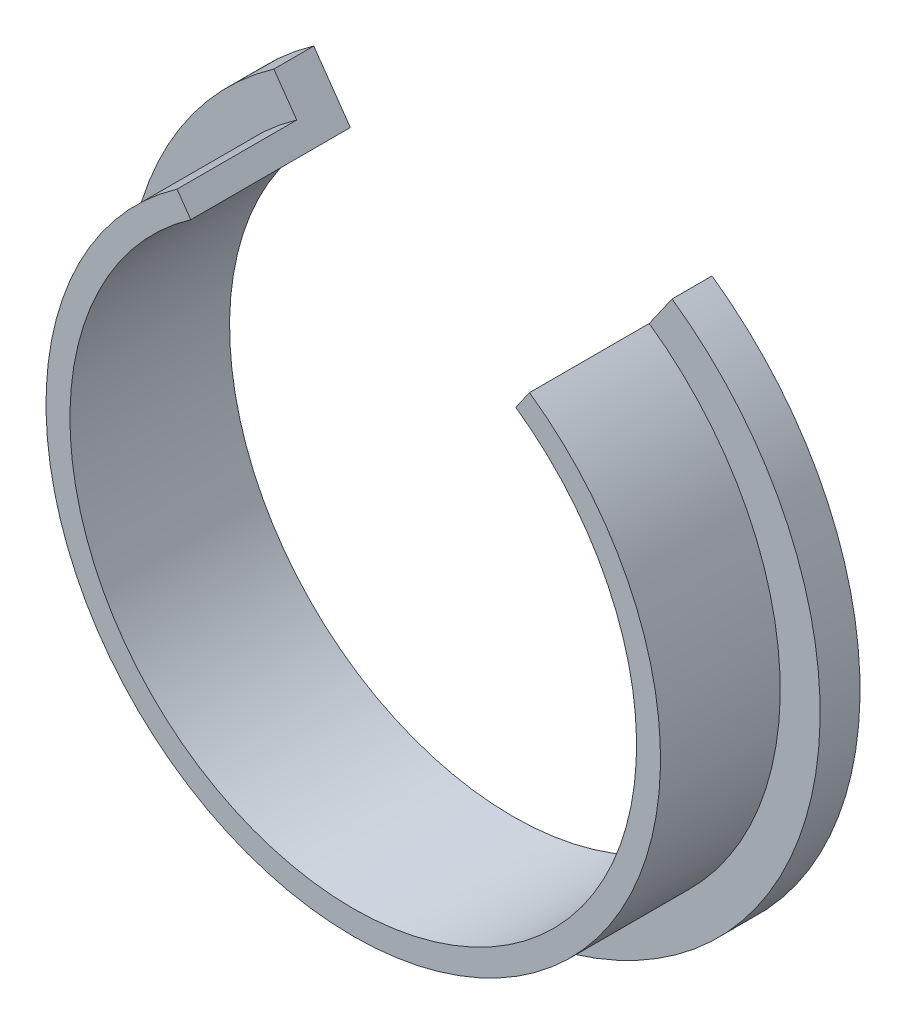
ISO-10303-21;
HEADER;
FILE_DESCRIPTION(('STEP AP214'),'2;1');
FILE_NAME('part.step','',(''),(''),'','','');
FILE_SCHEMA(('AUTOMOTIVE_DESIGN { 1 0 10303 214 1 1 1 1 }'));
ENDSEC;
DATA;
#1=APPLICATION_CONTEXT('core data for automotive mechanical design processes');
#2=APPLICATION_PROTOCOL_DEFINITION('international standard','automotive_design',2000,#1);
#3=PRODUCT_CONTEXT('',#1,'mechanical');
#4=PRODUCT('Part','Part','',(#3));
#5=PRODUCT_RELATED_PRODUCT_CATEGORY('part','',(#4));
#6=PRODUCT_DEFINITION_FORMATION('','',#4);
#7=PRODUCT_DEFINITION_CONTEXT('part definition',#1,'design');
#8=PRODUCT_DEFINITION('design','',#6,#7);
#9=PRODUCT_DEFINITION_SHAPE('','',#8);
#10=(LENGTH_UNIT() NAMED_UNIT(*) SI_UNIT(.MILLI.,.METRE.));
#11=(NAMED_UNIT(*) PLANE_ANGLE_UNIT() SI_UNIT($,.RADIAN.));
#12=(NAMED_UNIT(*) SI_UNIT($,.STERADIAN.) SOLID_ANGLE_UNIT());
#13=UNCERTAINTY_MEASURE_WITH_UNIT(LENGTH_MEASURE(1.E-05),#10,'distance_accuracy_value','');
#14=(GEOMETRIC_REPRESENTATION_CONTEXT(3) GLOBAL_UNCERTAINTY_ASSIGNED_CONTEXT((#13)) GLOBAL_UNIT_ASSIGNED_CONTEXT((#10,
#11,#12)) REPRESENTATION_CONTEXT('',''));
#15=CARTESIAN_POINT('',(0.,0.,0.));
#16=DIRECTION('',(0.,0.,1.));
#17=DIRECTION('',(1.,0.,0.));
#18=AXIS2_PLACEMENT_3D('',#15,#16,#17);
#19=CARTESIAN_POINT('',(0.,0.,5.));
#20=DIRECTION('',(0.,0.,-1.));
#21=DIRECTION('',(-1.,0.,0.));
#22=AXIS2_PLACEMENT_3D('',#19,#20,#21);
#23=CYLINDRICAL_SURFACE('',#22,43.5);
#24=CARTESIAN_POINT('',(0.,0.,0.));
#25=DIRECTION('',(0.,0.,1.));
#26=DIRECTION('',(1.,0.,0.));
#27=AXIS2_PLACEMENT_3D('',#24,#25,#26);
#28=CIRCLE('',#27,43.5);
#29=CARTESIAN_POINT('',(-24.9505749812706,35.6331139265711,0.));
#30=VERTEX_POINT('',#29);
#31=CARTESIAN_POINT('',(24.9505749812706,35.6331139265711,0.));
#32=VERTEX_POINT('',#31);
#33=EDGE_CURVE('E96',#30,#32,#28,.T.);
#34=ORIENTED_EDGE('',*,*,#33,.T.);
#35=DIRECTION('',(0.,0.,-1.));
#36=VECTOR('',#35,1.);
#37=CARTESIAN_POINT('',(24.9505749812706,35.6331139265711,20.));
#38=LINE('',#37,#36);
#39=CARTESIAN_POINT('',(24.9505749812706,35.6331139265711,5.));
#40=VERTEX_POINT('',#39);
#41=EDGE_CURVE('E99',#40,#32,#38,.T.);
#42=ORIENTED_EDGE('',*,*,#41,.F.);
#43=CARTESIAN_POINT('',(0.,0.,5.));
#44=DIRECTION('',(0.,0.,1.));
#45=DIRECTION('',(1.,0.,0.));
#46=AXIS2_PLACEMENT_3D('',#43,#44,#45);
#47=CIRCLE('',#46,43.5);
#48=CARTESIAN_POINT('',(-24.9505749812706,35.6331139265711,5.));
#49=VERTEX_POINT('',#48);
#50=EDGE_CURVE('E98',#49,#40,#47,.T.);
#51=ORIENTED_EDGE('',*,*,#50,.F.);
#52=DIRECTION('',(0.,0.,-1.));
#53=VECTOR('',#52,1.);
#54=CARTESIAN_POINT('',(-24.9505749812706,35.6331139265711,20.));
#55=LINE('',#54,#53);
#56=EDGE_CURVE('E84',#49,#30,#55,.T.);
#57=ORIENTED_EDGE('',*,*,#56,.T.);
#58=EDGE_LOOP('',(#34,#42,#51,#57));
#59=FACE_BOUND('',#58,.T.);
#60=ADVANCED_FACE('F32',(#59),#23,.T.);
#61=CARTESIAN_POINT('',(0.,0.,5.));
#62=DIRECTION('',(0.,0.,1.));
#63=DIRECTION('',(1.,0.,0.));
#64=AXIS2_PLACEMENT_3D('',#61,#62,#63);
#65=PLANE('',#64);
#66=DIRECTION('',(0.573576436351047,0.819152044288991,0.));
#67=VECTOR('',#66,1.);
#68=CARTESIAN_POINT('',(0.,0.,5.));
#69=LINE('',#68,#67);
#70=CARTESIAN_POINT('',(22.0826927995153,31.5373537051262,5.));
#71=VERTEX_POINT('',#70);
#72=EDGE_CURVE('E121',#71,#40,#69,.T.);
#73=ORIENTED_EDGE('',*,*,#72,.F.);
#74=CARTESIAN_POINT('',(0.,0.,5.));
#75=DIRECTION('',(0.,0.,1.));
#76=DIRECTION('',(1.,0.,0.));
#77=AXIS2_PLACEMENT_3D('',#74,#75,#76);
#78=CIRCLE('',#77,38.5);
#79=CARTESIAN_POINT('',(-22.0826927995153,31.5373537051262,5.));
#80=VERTEX_POINT('',#79);
#81=EDGE_CURVE('E104',#80,#71,#78,.T.);
#82=ORIENTED_EDGE('',*,*,#81,.F.);
#83=DIRECTION('',(0.573576436351047,-0.819152044288991,0.));
#84=VECTOR('',#83,1.);
#85=CARTESIAN_POINT('',(0.,0.,5.));
#86=LINE('',#85,#84);
#87=EDGE_CURVE('E126',#49,#80,#86,.T.);
#88=ORIENTED_EDGE('',*,*,#87,.F.);
#89=ORIENTED_EDGE('',*,*,#50,.T.);
#90=EDGE_LOOP('',(#73,#82,#88,#89));
#91=FACE_BOUND('',#90,.T.);
#92=ADVANCED_FACE('F148',(#91),#65,.T.);
#93=CARTESIAN_POINT('',(0.,0.,0.));
#94=DIRECTION('',(0.,0.,1.));
#95=DIRECTION('',(1.,0.,0.));
#96=AXIS2_PLACEMENT_3D('',#93,#94,#95);
#97=PLANE('',#96);
#98=CARTESIAN_POINT('',(0.,0.,0.));
#99=DIRECTION('',(0.,0.,1.));
#100=DIRECTION('',(1.,0.,0.));
#101=AXIS2_PLACEMENT_3D('',#98,#99,#100);
#102=CIRCLE('',#101,35.5);
#103=CARTESIAN_POINT('',(-20.3619634904622,29.0798975722592,0.));
#104=VERTEX_POINT('',#103);
#105=CARTESIAN_POINT('',(20.3619634904622,29.0798975722592,0.));
#106=VERTEX_POINT('',#105);
#107=EDGE_CURVE('E107',#104,#106,#102,.T.);
#108=ORIENTED_EDGE('',*,*,#107,.T.);
#109=DIRECTION('',(-0.573576436351047,-0.819152044288991,0.));
#110=VECTOR('',#109,1.);
#111=CARTESIAN_POINT('',(0.,0.,0.));
#112=LINE('',#111,#110);
#113=EDGE_CURVE('E54',#32,#106,#112,.T.);
#114=ORIENTED_EDGE('',*,*,#113,.F.);
#115=ORIENTED_EDGE('',*,*,#33,.F.);
#116=DIRECTION('',(-0.573576436351047,0.819152044288991,0.));
#117=VECTOR('',#116,1.);
#118=CARTESIAN_POINT('',(0.,0.,0.));
#119=LINE('',#118,#117);
#120=EDGE_CURVE('E81',#104,#30,#119,.T.);
#121=ORIENTED_EDGE('',*,*,#120,.F.);
#122=EDGE_LOOP('',(#108,#114,#115,#121));
#123=FACE_BOUND('',#122,.T.);
#124=ADVANCED_FACE('F101',(#123),#97,.F.);
#125=CARTESIAN_POINT('',(0.,0.,20.));
#126=DIRECTION('',(0.,0.,-1.));
#127=DIRECTION('',(-1.,0.,0.));
#128=AXIS2_PLACEMENT_3D('',#125,#126,#127);
#129=CYLINDRICAL_SURFACE('',#128,38.5);
#130=ORIENTED_EDGE('',*,*,#81,.T.);
#131=DIRECTION('',(0.,0.,-1.));
#132=VECTOR('',#131,1.);
#133=CARTESIAN_POINT('',(22.0826927995153,31.5373537051262,20.));
#134=LINE('',#133,#132);
#135=CARTESIAN_POINT('',(22.0826927995153,31.5373537051262,20.));
#136=VERTEX_POINT('',#135);
#137=EDGE_CURVE('E124',#71,#136,#134,.F.);
#138=ORIENTED_EDGE('',*,*,#137,.T.);
#139=CARTESIAN_POINT('',(0.,0.,20.));
#140=DIRECTION('',(0.,0.,1.));
#141=DIRECTION('',(1.,0.,0.));
#142=AXIS2_PLACEMENT_3D('',#139,#140,#141);
#143=CIRCLE('',#142,38.5);
#144=CARTESIAN_POINT('',(-22.0826927995153,31.5373537051262,20.));
#145=VERTEX_POINT('',#144);
#146=EDGE_CURVE('E102',#145,#136,#143,.T.);
#147=ORIENTED_EDGE('',*,*,#146,.F.);
#148=DIRECTION('',(0.,0.,-1.));
#149=VECTOR('',#148,1.);
#150=CARTESIAN_POINT('',(-22.0826927995153,31.5373537051262,20.));
#151=LINE('',#150,#149);
#152=EDGE_CURVE('E128',#145,#80,#151,.T.);
#153=ORIENTED_EDGE('',*,*,#152,.T.);
#154=EDGE_LOOP('',(#130,#138,#147,#153));
#155=FACE_BOUND('',#154,.T.);
#156=ADVANCED_FACE('F157',(#155),#129,.T.);
#157=CARTESIAN_POINT('',(0.,0.,20.));
#158=DIRECTION('',(0.,0.,1.));
#159=DIRECTION('',(1.,0.,0.));
#160=AXIS2_PLACEMENT_3D('',#157,#158,#159);
#161=PLANE('',#160);
#162=DIRECTION('',(-0.573576436351047,-0.819152044288991,0.));
#163=VECTOR('',#162,1.);
#164=CARTESIAN_POINT('',(0.,0.,20.));
#165=LINE('',#164,#163);
#166=CARTESIAN_POINT('',(20.3619634904622,29.0798975722592,20.));
#167=VERTEX_POINT('',#166);
#168=EDGE_CURVE('E90',#136,#167,#165,.T.);
#169=ORIENTED_EDGE('',*,*,#168,.T.);
#170=CARTESIAN_POINT('',(0.,0.,20.));
#171=DIRECTION('',(0.,0.,1.));
#172=DIRECTION('',(1.,0.,0.));
#173=AXIS2_PLACEMENT_3D('',#170,#171,#172);
#174=CIRCLE('',#173,35.5);
#175=CARTESIAN_POINT('',(-20.3619634904622,29.0798975722592,20.));
#176=VERTEX_POINT('',#175);
#177=EDGE_CURVE('E119',#176,#167,#174,.T.);
#178=ORIENTED_EDGE('',*,*,#177,.F.);
#179=DIRECTION('',(-0.573576436351047,0.819152044288991,0.));
#180=VECTOR('',#179,1.);
#181=CARTESIAN_POINT('',(0.,0.,20.));
#182=LINE('',#181,#180);
#183=EDGE_CURVE('E46',#176,#145,#182,.T.);
#184=ORIENTED_EDGE('',*,*,#183,.T.);
#185=ORIENTED_EDGE('',*,*,#146,.T.);
#186=EDGE_LOOP('',(#169,#178,#184,#185));
#187=FACE_BOUND('',#186,.T.);
#188=ADVANCED_FACE('F135',(#187),#161,.T.);
#189=CARTESIAN_POINT('',(0.,0.,0.));
#190=DIRECTION('',(0.,0.,1.));
#191=DIRECTION('',(1.,0.,0.));
#192=AXIS2_PLACEMENT_3D('',#189,#190,#191);
#193=CYLINDRICAL_SURFACE('',#192,35.5);
#194=ORIENTED_EDGE('',*,*,#177,.T.);
#195=DIRECTION('',(0.,0.,1.));
#196=VECTOR('',#195,1.);
#197=CARTESIAN_POINT('',(20.3619634904622,29.0798975722592,0.));
#198=LINE('',#197,#196);
#199=EDGE_CURVE('E11',#167,#106,#198,.F.);
#200=ORIENTED_EDGE('',*,*,#199,.T.);
#201=ORIENTED_EDGE('',*,*,#107,.F.);
#202=DIRECTION('',(0.,0.,1.));
#203=VECTOR('',#202,1.);
#204=CARTESIAN_POINT('',(-20.3619634904622,29.0798975722592,0.));
#205=LINE('',#204,#203);
#206=EDGE_CURVE('E39',#104,#176,#205,.T.);
#207=ORIENTED_EDGE('',*,*,#206,.T.);
#208=EDGE_LOOP('',(#194,#200,#201,#207));
#209=FACE_BOUND('',#208,.T.);
#210=ADVANCED_FACE('F137',(#209),#193,.F.);
#211=CARTESIAN_POINT('',(0.,0.,20.));
#212=DIRECTION('',(-0.819152044288991,-0.573576436351047,0.));
#213=DIRECTION('',(0.573576436351047,-0.819152044288991,0.));
#214=AXIS2_PLACEMENT_3D('',#211,#212,#213);
#215=PLANE('',#214);
#216=ORIENTED_EDGE('',*,*,#87,.T.);
#217=ORIENTED_EDGE('',*,*,#152,.F.);
#218=ORIENTED_EDGE('',*,*,#183,.F.);
#219=ORIENTED_EDGE('',*,*,#206,.F.);
#220=ORIENTED_EDGE('',*,*,#120,.T.);
#221=ORIENTED_EDGE('',*,*,#56,.F.);
#222=EDGE_LOOP('',(#216,#217,#218,#219,#220,#221));
#223=FACE_BOUND('',#222,.T.);
#224=ADVANCED_FACE('F83',(#223),#215,.F.);
#225=CARTESIAN_POINT('',(0.,0.,20.));
#226=DIRECTION('',(0.819152044288991,-0.573576436351047,0.));
#227=DIRECTION('',(0.573576436351047,0.819152044288991,0.));
#228=AXIS2_PLACEMENT_3D('',#225,#226,#227);
#229=PLANE('',#228);
#230=ORIENTED_EDGE('',*,*,#72,.T.);
#231=ORIENTED_EDGE('',*,*,#41,.T.);
#232=ORIENTED_EDGE('',*,*,#113,.T.);
#233=ORIENTED_EDGE('',*,*,#199,.F.);
#234=ORIENTED_EDGE('',*,*,#168,.F.);
#235=ORIENTED_EDGE('',*,*,#137,.F.);
#236=EDGE_LOOP('',(#230,#231,#232,#233,#234,#235));
#237=FACE_BOUND('',#236,.T.);
#238=ADVANCED_FACE('F138',(#237),#229,.F.);
#239=CLOSED_SHELL('',(#60,#92,#124,#156,#188,#210,#224,#238));
#240=MANIFOLD_SOLID_BREP('B2',#239);
#241=ADVANCED_BREP_SHAPE_REPRESENTATION('',(#18,#240),#14);
#242=SHAPE_DEFINITION_REPRESENTATION(#9,#241);
ENDSEC;
END-ISO-10303-21;
